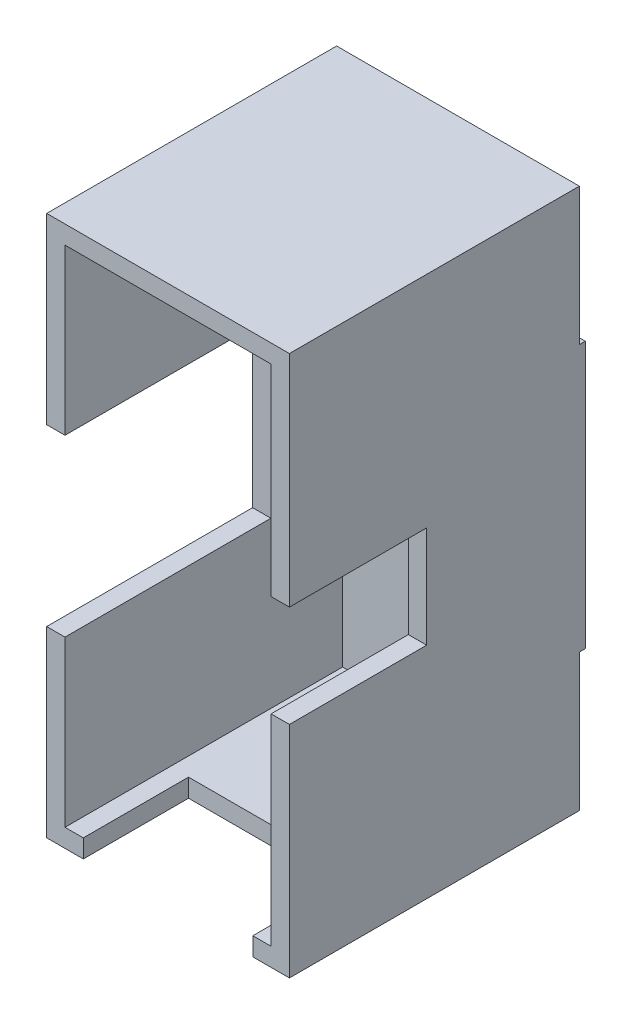
ISO-10303-21;
HEADER;
FILE_DESCRIPTION(('STEP AP214'),'2;1');
FILE_NAME('part.step','',(''),(''),'','','');
FILE_SCHEMA(('AUTOMOTIVE_DESIGN { 1 0 10303 214 1 1 1 1 }'));
ENDSEC;
DATA;
#1=APPLICATION_CONTEXT('core data for automotive mechanical design processes');
#2=APPLICATION_PROTOCOL_DEFINITION('international standard','automotive_design',2000,#1);
#3=PRODUCT_CONTEXT('',#1,'mechanical');
#4=PRODUCT('Part','Part','',(#3));
#5=PRODUCT_RELATED_PRODUCT_CATEGORY('part','',(#4));
#6=PRODUCT_DEFINITION_FORMATION('','',#4);
#7=PRODUCT_DEFINITION_CONTEXT('part definition',#1,'design');
#8=PRODUCT_DEFINITION('design','',#6,#7);
#9=PRODUCT_DEFINITION_SHAPE('','',#8);
#10=(LENGTH_UNIT() NAMED_UNIT(*) SI_UNIT(.MILLI.,.METRE.));
#11=(NAMED_UNIT(*) PLANE_ANGLE_UNIT() SI_UNIT($,.RADIAN.));
#12=(NAMED_UNIT(*) SI_UNIT($,.STERADIAN.) SOLID_ANGLE_UNIT());
#13=UNCERTAINTY_MEASURE_WITH_UNIT(LENGTH_MEASURE(1.E-05),#10,'distance_accuracy_value','');
#14=(GEOMETRIC_REPRESENTATION_CONTEXT(3) GLOBAL_UNCERTAINTY_ASSIGNED_CONTEXT((#13)) GLOBAL_UNIT_ASSIGNED_CONTEXT((#10,
#11,#12)) REPRESENTATION_CONTEXT('',''));
#15=CARTESIAN_POINT('',(0.,0.,0.));
#16=DIRECTION('',(0.,0.,1.));
#17=DIRECTION('',(1.,0.,0.));
#18=AXIS2_PLACEMENT_3D('',#15,#16,#17);
#19=CARTESIAN_POINT('',(26.525,59.1,60.67));
#20=DIRECTION('',(-1.,0.,0.));
#21=DIRECTION('',(0.,0.,1.));
#22=AXIS2_PLACEMENT_3D('',#19,#20,#21);
#23=PLANE('',#22);
#24=DIRECTION('',(0.,0.,1.));
#25=VECTOR('',#24,1.);
#26=CARTESIAN_POINT('',(26.525,29.1,-3.10648942467232E-13));
#27=LINE('',#26,#25);
#28=CARTESIAN_POINT('',(26.525,29.1,-4.));
#29=VERTEX_POINT('',#28);
#30=CARTESIAN_POINT('',(26.525,29.1,-2.7));
#31=VERTEX_POINT('',#30);
#32=EDGE_CURVE('E66',#29,#31,#27,.T.);
#33=ORIENTED_EDGE('',*,*,#32,.T.);
#34=DIRECTION('',(0.,-1.,0.));
#35=VECTOR('',#34,1.);
#36=CARTESIAN_POINT('',(26.525,0.,-2.7));
#37=LINE('',#36,#35);
#38=CARTESIAN_POINT('',(26.525,59.1,-2.7));
#39=VERTEX_POINT('',#38);
#40=EDGE_CURVE('E445',#39,#31,#37,.T.);
#41=ORIENTED_EDGE('',*,*,#40,.F.);
#42=DIRECTION('',(0.,0.,-1.));
#43=VECTOR('',#42,1.);
#44=CARTESIAN_POINT('',(26.525,59.1,60.67));
#45=LINE('',#44,#43);
#46=CARTESIAN_POINT('',(26.525,59.1,60.67));
#47=VERTEX_POINT('',#46);
#48=EDGE_CURVE('E11',#47,#39,#45,.T.);
#49=ORIENTED_EDGE('',*,*,#48,.F.);
#50=DIRECTION('',(0.,1.,0.));
#51=VECTOR('',#50,1.);
#52=CARTESIAN_POINT('',(26.525,59.1,60.67));
#53=LINE('',#52,#51);
#54=CARTESIAN_POINT('',(26.525,11.1,60.67));
#55=VERTEX_POINT('',#54);
#56=EDGE_CURVE('E255',#55,#47,#53,.T.);
#57=ORIENTED_EDGE('',*,*,#56,.F.);
#58=DIRECTION('',(0.,0.,1.));
#59=VECTOR('',#58,1.);
#60=CARTESIAN_POINT('',(26.525,11.1,60.67));
#61=LINE('',#60,#59);
#62=CARTESIAN_POINT('',(26.525,11.1,30.67));
#63=VERTEX_POINT('',#62);
#64=EDGE_CURVE('E325',#63,#55,#61,.T.);
#65=ORIENTED_EDGE('',*,*,#64,.F.);
#66=DIRECTION('',(0.,1.,0.));
#67=VECTOR('',#66,1.);
#68=CARTESIAN_POINT('',(26.525,11.1,30.67));
#69=LINE('',#68,#67);
#70=CARTESIAN_POINT('',(26.525,-11.1,30.67));
#71=VERTEX_POINT('',#70);
#72=EDGE_CURVE('E329',#71,#63,#69,.T.);
#73=ORIENTED_EDGE('',*,*,#72,.F.);
#74=DIRECTION('',(0.,0.,-1.));
#75=VECTOR('',#74,1.);
#76=CARTESIAN_POINT('',(26.525,-11.1,60.67));
#77=LINE('',#76,#75);
#78=CARTESIAN_POINT('',(26.525,-11.1,60.67));
#79=VERTEX_POINT('',#78);
#80=EDGE_CURVE('E333',#79,#71,#77,.T.);
#81=ORIENTED_EDGE('',*,*,#80,.F.);
#82=CARTESIAN_POINT('',(26.525,-59.1,60.67));
#83=VERTEX_POINT('',#82);
#84=EDGE_CURVE('E251',#83,#79,#53,.T.);
#85=ORIENTED_EDGE('',*,*,#84,.F.);
#86=DIRECTION('',(0.,0.,-1.));
#87=VECTOR('',#86,1.);
#88=CARTESIAN_POINT('',(26.525,-59.1,60.67));
#89=LINE('',#88,#87);
#90=CARTESIAN_POINT('',(26.525,-59.1,-2.7));
#91=VERTEX_POINT('',#90);
#92=EDGE_CURVE('E234',#83,#91,#89,.T.);
#93=ORIENTED_EDGE('',*,*,#92,.T.);
#94=DIRECTION('',(0.,1.,0.));
#95=VECTOR('',#94,1.);
#96=CARTESIAN_POINT('',(26.525,-59.1,-2.7));
#97=LINE('',#96,#95);
#98=CARTESIAN_POINT('',(26.525,-29.1,-2.7));
#99=VERTEX_POINT('',#98);
#100=EDGE_CURVE('E436',#91,#99,#97,.T.);
#101=ORIENTED_EDGE('',*,*,#100,.T.);
#102=DIRECTION('',(0.,0.,1.));
#103=VECTOR('',#102,1.);
#104=CARTESIAN_POINT('',(26.525,-29.1,-4.));
#105=LINE('',#104,#103);
#106=CARTESIAN_POINT('',(26.525,-29.1,-4.));
#107=VERTEX_POINT('',#106);
#108=EDGE_CURVE('E441',#107,#99,#105,.T.);
#109=ORIENTED_EDGE('',*,*,#108,.F.);
#110=DIRECTION('',(0.,1.,0.));
#111=VECTOR('',#110,1.);
#112=CARTESIAN_POINT('',(26.525,-59.1000000000002,-4.));
#113=LINE('',#112,#111);
#114=EDGE_CURVE('E307',#107,#29,#113,.T.);
#115=ORIENTED_EDGE('',*,*,#114,.T.);
#116=EDGE_LOOP('',(#33,#41,#49,#57,#65,#73,#81,#85,#93,#101,#109,#115));
#117=FACE_BOUND('',#116,.T.);
#118=ADVANCED_FACE('F43',(#117),#23,.F.);
#119=CARTESIAN_POINT('',(-26.525,59.1,60.67));
#120=DIRECTION('',(1.,0.,0.));
#121=DIRECTION('',(0.,0.,-1.));
#122=AXIS2_PLACEMENT_3D('',#119,#120,#121);
#123=PLANE('',#122);
#124=DIRECTION('',(0.,0.,1.));
#125=VECTOR('',#124,1.);
#126=CARTESIAN_POINT('',(-26.5250000000001,29.1,-3.10648942467232E-13));
#127=LINE('',#126,#125);
#128=CARTESIAN_POINT('',(-26.5250000000001,29.1,-4.));
#129=VERTEX_POINT('',#128);
#130=CARTESIAN_POINT('',(-26.5250000000001,29.1,-2.7));
#131=VERTEX_POINT('',#130);
#132=EDGE_CURVE('E216',#129,#131,#127,.T.);
#133=ORIENTED_EDGE('',*,*,#132,.F.);
#134=DIRECTION('',(0.,1.,0.));
#135=VECTOR('',#134,1.);
#136=CARTESIAN_POINT('',(-26.5250000000001,-59.1000000000002,-4.));
#137=LINE('',#136,#135);
#138=CARTESIAN_POINT('',(-26.5250000000001,-29.1,-4.));
#139=VERTEX_POINT('',#138);
#140=EDGE_CURVE('E287',#139,#129,#137,.T.);
#141=ORIENTED_EDGE('',*,*,#140,.F.);
#142=DIRECTION('',(0.,0.,1.));
#143=VECTOR('',#142,1.);
#144=CARTESIAN_POINT('',(-26.5250000000001,-29.1,-4.));
#145=LINE('',#144,#143);
#146=CARTESIAN_POINT('',(-26.5250000000001,-29.1,-2.7));
#147=VERTEX_POINT('',#146);
#148=EDGE_CURVE('E58',#139,#147,#145,.T.);
#149=ORIENTED_EDGE('',*,*,#148,.T.);
#150=DIRECTION('',(0.,1.,0.));
#151=VECTOR('',#150,1.);
#152=CARTESIAN_POINT('',(-26.5250000000001,-59.1,-2.7));
#153=LINE('',#152,#151);
#154=CARTESIAN_POINT('',(-26.5250000000001,-59.1,-2.7));
#155=VERTEX_POINT('',#154);
#156=EDGE_CURVE('E437',#155,#147,#153,.T.);
#157=ORIENTED_EDGE('',*,*,#156,.F.);
#158=DIRECTION('',(0.,0.,-1.));
#159=VECTOR('',#158,1.);
#160=CARTESIAN_POINT('',(-26.525,-59.1,60.67));
#161=LINE('',#160,#159);
#162=CARTESIAN_POINT('',(-26.525,-59.1,60.67));
#163=VERTEX_POINT('',#162);
#164=EDGE_CURVE('E231',#163,#155,#161,.T.);
#165=ORIENTED_EDGE('',*,*,#164,.F.);
#166=DIRECTION('',(0.,-1.,0.));
#167=VECTOR('',#166,1.);
#168=CARTESIAN_POINT('',(-26.525,59.1,60.67));
#169=LINE('',#168,#167);
#170=CARTESIAN_POINT('',(-26.525,-19.1,60.67));
#171=VERTEX_POINT('',#170);
#172=EDGE_CURVE('E247',#171,#163,#169,.T.);
#173=ORIENTED_EDGE('',*,*,#172,.F.);
#174=DIRECTION('',(0.,0.,1.));
#175=VECTOR('',#174,1.);
#176=CARTESIAN_POINT('',(-26.525,-19.1,60.67));
#177=LINE('',#176,#175);
#178=CARTESIAN_POINT('',(-26.525,-19.1,15.67));
#179=VERTEX_POINT('',#178);
#180=EDGE_CURVE('E361',#179,#171,#177,.T.);
#181=ORIENTED_EDGE('',*,*,#180,.F.);
#182=DIRECTION('',(0.,-1.,0.));
#183=VECTOR('',#182,1.);
#184=CARTESIAN_POINT('',(-26.525,19.1,15.67));
#185=LINE('',#184,#183);
#186=CARTESIAN_POINT('',(-26.525,19.1,15.67));
#187=VERTEX_POINT('',#186);
#188=EDGE_CURVE('E365',#187,#179,#185,.T.);
#189=ORIENTED_EDGE('',*,*,#188,.F.);
#190=DIRECTION('',(0.,0.,-1.));
#191=VECTOR('',#190,1.);
#192=CARTESIAN_POINT('',(-26.525,19.1,60.67));
#193=LINE('',#192,#191);
#194=CARTESIAN_POINT('',(-26.525,19.1,60.67));
#195=VERTEX_POINT('',#194);
#196=EDGE_CURVE('E369',#195,#187,#193,.T.);
#197=ORIENTED_EDGE('',*,*,#196,.F.);
#198=CARTESIAN_POINT('',(-26.525,59.1,60.67));
#199=VERTEX_POINT('',#198);
#200=EDGE_CURVE('E229',#199,#195,#169,.T.);
#201=ORIENTED_EDGE('',*,*,#200,.F.);
#202=DIRECTION('',(0.,0.,-1.));
#203=VECTOR('',#202,1.);
#204=CARTESIAN_POINT('',(-26.525,59.1,60.67));
#205=LINE('',#204,#203);
#206=CARTESIAN_POINT('',(-26.5250000000001,59.1,-2.7));
#207=VERTEX_POINT('',#206);
#208=EDGE_CURVE('E51',#199,#207,#205,.T.);
#209=ORIENTED_EDGE('',*,*,#208,.T.);
#210=DIRECTION('',(0.,-1.,0.));
#211=VECTOR('',#210,1.);
#212=CARTESIAN_POINT('',(-26.5250000000001,0.,-2.7));
#213=LINE('',#212,#211);
#214=EDGE_CURVE('E205',#207,#131,#213,.T.);
#215=ORIENTED_EDGE('',*,*,#214,.T.);
#216=EDGE_LOOP('',(#133,#141,#149,#157,#165,#173,#181,#189,#197,#201,#209,#215));
#217=FACE_BOUND('',#216,.T.);
#218=ADVANCED_FACE('F226',(#217),#123,.F.);
#219=CARTESIAN_POINT('',(-26.525,-59.1,60.67));
#220=DIRECTION('',(0.,1.,0.));
#221=DIRECTION('',(0.,0.,1.));
#222=AXIS2_PLACEMENT_3D('',#219,#220,#221);
#223=PLANE('',#222);
#224=DIRECTION('',(1.,0.,0.));
#225=VECTOR('',#224,1.);
#226=CARTESIAN_POINT('',(-26.5250000000001,-59.1,-2.7));
#227=LINE('',#226,#225);
#228=EDGE_CURVE('E451',#155,#91,#227,.T.);
#229=ORIENTED_EDGE('',*,*,#228,.T.);
#230=ORIENTED_EDGE('',*,*,#92,.F.);
#231=DIRECTION('',(1.,0.,0.));
#232=VECTOR('',#231,1.);
#233=CARTESIAN_POINT('',(-26.525,-59.1,60.67));
#234=LINE('',#233,#232);
#235=CARTESIAN_POINT('',(18.525,-59.1,60.67));
#236=VERTEX_POINT('',#235);
#237=EDGE_CURVE('E244',#236,#83,#234,.T.);
#238=ORIENTED_EDGE('',*,*,#237,.F.);
#239=DIRECTION('',(0.,0.,1.));
#240=VECTOR('',#239,1.);
#241=CARTESIAN_POINT('',(18.525,-59.1,60.67));
#242=LINE('',#241,#240);
#243=CARTESIAN_POINT('',(18.525,-59.1,37.67));
#244=VERTEX_POINT('',#243);
#245=EDGE_CURVE('E397',#244,#236,#242,.T.);
#246=ORIENTED_EDGE('',*,*,#245,.F.);
#247=DIRECTION('',(1.,0.,0.));
#248=VECTOR('',#247,1.);
#249=CARTESIAN_POINT('',(-18.525,-59.1,37.67));
#250=LINE('',#249,#248);
#251=CARTESIAN_POINT('',(-18.525,-59.1,37.67));
#252=VERTEX_POINT('',#251);
#253=EDGE_CURVE('E401',#252,#244,#250,.T.);
#254=ORIENTED_EDGE('',*,*,#253,.F.);
#255=DIRECTION('',(0.,0.,-1.));
#256=VECTOR('',#255,1.);
#257=CARTESIAN_POINT('',(-18.525,-59.1,60.67));
#258=LINE('',#257,#256);
#259=CARTESIAN_POINT('',(-18.525,-59.1,60.67));
#260=VERTEX_POINT('',#259);
#261=EDGE_CURVE('E405',#260,#252,#258,.T.);
#262=ORIENTED_EDGE('',*,*,#261,.F.);
#263=EDGE_CURVE('E240',#163,#260,#234,.T.);
#264=ORIENTED_EDGE('',*,*,#263,.F.);
#265=ORIENTED_EDGE('',*,*,#164,.T.);
#266=EDGE_LOOP('',(#229,#230,#238,#246,#254,#262,#264,#265));
#267=FACE_BOUND('',#266,.T.);
#268=ADVANCED_FACE('F511',(#267),#223,.F.);
#269=CARTESIAN_POINT('',(0.,0.,-4.));
#270=DIRECTION('',(0.,0.,1.));
#271=DIRECTION('',(1.,0.,0.));
#272=AXIS2_PLACEMENT_3D('',#269,#270,#271);
#273=PLANE('',#272);
#274=CARTESIAN_POINT('',(0.,0.,-4.));
#275=DIRECTION('',(0.,0.,-1.));
#276=DIRECTION('',(-1.,0.,0.));
#277=AXIS2_PLACEMENT_3D('',#274,#275,#276);
#278=CIRCLE('',#277,11.5);
#279=CARTESIAN_POINT('',(-11.5,0.,-4.));
#280=VERTEX_POINT('',#279);
#281=EDGE_CURVE('E423',#280,#280,#278,.T.);
#282=ORIENTED_EDGE('',*,*,#281,.F.);
#283=EDGE_LOOP('',(#282));
#284=FACE_BOUND('',#283,.T.);
#285=DIRECTION('',(1.,0.,0.));
#286=VECTOR('',#285,1.);
#287=CARTESIAN_POINT('',(-26.5250000000001,29.1,-4.));
#288=LINE('',#287,#286);
#289=EDGE_CURVE('E433',#129,#29,#288,.T.);
#290=ORIENTED_EDGE('',*,*,#289,.T.);
#291=ORIENTED_EDGE('',*,*,#114,.F.);
#292=DIRECTION('',(1.,0.,0.));
#293=VECTOR('',#292,1.);
#294=CARTESIAN_POINT('',(-26.5250000000001,-29.1,-4.));
#295=LINE('',#294,#293);
#296=EDGE_CURVE('E428',#139,#107,#295,.T.);
#297=ORIENTED_EDGE('',*,*,#296,.F.);
#298=ORIENTED_EDGE('',*,*,#140,.T.);
#299=EDGE_LOOP('',(#290,#291,#297,#298));
#300=FACE_BOUND('',#299,.T.);
#301=ADVANCED_FACE('F516',(#284,#300),#273,.F.);
#302=CARTESIAN_POINT('',(0.,0.,60.67));
#303=DIRECTION('',(0.,0.,1.));
#304=DIRECTION('',(1.,0.,0.));
#305=AXIS2_PLACEMENT_3D('',#302,#303,#304);
#306=PLANE('',#305);
#307=DIRECTION('',(0.,-1.,0.));
#308=VECTOR('',#307,1.);
#309=CARTESIAN_POINT('',(-18.525,-55.1,60.67));
#310=LINE('',#309,#308);
#311=CARTESIAN_POINT('',(-18.525,-55.1,60.67));
#312=VERTEX_POINT('',#311);
#313=EDGE_CURVE('E373',#312,#260,#310,.T.);
#314=ORIENTED_EDGE('',*,*,#313,.F.);
#315=DIRECTION('',(1.,0.,0.));
#316=VECTOR('',#315,1.);
#317=CARTESIAN_POINT('',(-22.525,-55.1,60.67));
#318=LINE('',#317,#316);
#319=CARTESIAN_POINT('',(-22.525,-55.1,60.67));
#320=VERTEX_POINT('',#319);
#321=EDGE_CURVE('E269',#320,#312,#318,.T.);
#322=ORIENTED_EDGE('',*,*,#321,.F.);
#323=DIRECTION('',(0.,-1.,0.));
#324=VECTOR('',#323,1.);
#325=CARTESIAN_POINT('',(-22.525,-55.1,60.67));
#326=LINE('',#325,#324);
#327=CARTESIAN_POINT('',(-22.525,-19.1,60.67));
#328=VERTEX_POINT('',#327);
#329=EDGE_CURVE('E296',#328,#320,#326,.T.);
#330=ORIENTED_EDGE('',*,*,#329,.F.);
#331=DIRECTION('',(-1.,0.,0.));
#332=VECTOR('',#331,1.);
#333=CARTESIAN_POINT('',(-22.525,-19.1,60.67));
#334=LINE('',#333,#332);
#335=EDGE_CURVE('E337',#328,#171,#334,.T.);
#336=ORIENTED_EDGE('',*,*,#335,.T.);
#337=ORIENTED_EDGE('',*,*,#172,.T.);
#338=ORIENTED_EDGE('',*,*,#263,.T.);
#339=EDGE_LOOP('',(#314,#322,#330,#336,#337,#338));
#340=FACE_BOUND('',#339,.T.);
#341=ADVANCED_FACE('F530',(#340),#306,.T.);
#342=DIRECTION('',(0.,-1.,0.));
#343=VECTOR('',#342,1.);
#344=CARTESIAN_POINT('',(18.525,-55.1,60.67));
#345=LINE('',#344,#343);
#346=CARTESIAN_POINT('',(18.525,-55.1,60.67));
#347=VERTEX_POINT('',#346);
#348=EDGE_CURVE('E391',#347,#236,#345,.T.);
#349=ORIENTED_EDGE('',*,*,#348,.T.);
#350=ORIENTED_EDGE('',*,*,#237,.T.);
#351=ORIENTED_EDGE('',*,*,#84,.T.);
#352=DIRECTION('',(1.,0.,0.));
#353=VECTOR('',#352,1.);
#354=CARTESIAN_POINT('',(22.525,-11.1,60.67));
#355=LINE('',#354,#353);
#356=CARTESIAN_POINT('',(22.525,-11.1,60.67));
#357=VERTEX_POINT('',#356);
#358=EDGE_CURVE('E312',#357,#79,#355,.T.);
#359=ORIENTED_EDGE('',*,*,#358,.F.);
#360=DIRECTION('',(0.,1.,0.));
#361=VECTOR('',#360,1.);
#362=CARTESIAN_POINT('',(22.525,-55.1,60.67));
#363=LINE('',#362,#361);
#364=CARTESIAN_POINT('',(22.525,-55.1,60.67));
#365=VERTEX_POINT('',#364);
#366=EDGE_CURVE('E300',#365,#357,#363,.T.);
#367=ORIENTED_EDGE('',*,*,#366,.F.);
#368=EDGE_CURVE('E291',#347,#365,#318,.T.);
#369=ORIENTED_EDGE('',*,*,#368,.F.);
#370=EDGE_LOOP('',(#349,#350,#351,#359,#367,#369));
#371=FACE_BOUND('',#370,.T.);
#372=ADVANCED_FACE('F567',(#371),#306,.T.);
#373=DIRECTION('',(-1.,0.,0.));
#374=VECTOR('',#373,1.);
#375=CARTESIAN_POINT('',(-22.525,19.1,60.67));
#376=LINE('',#375,#374);
#377=CARTESIAN_POINT('',(-22.525,19.1,60.67));
#378=VERTEX_POINT('',#377);
#379=EDGE_CURVE('E348',#378,#195,#376,.T.);
#380=ORIENTED_EDGE('',*,*,#379,.F.);
#381=CARTESIAN_POINT('',(-22.525,55.1,60.67));
#382=VERTEX_POINT('',#381);
#383=EDGE_CURVE('E292',#382,#378,#326,.T.);
#384=ORIENTED_EDGE('',*,*,#383,.F.);
#385=DIRECTION('',(-1.,0.,0.));
#386=VECTOR('',#385,1.);
#387=CARTESIAN_POINT('',(-22.525,55.1,60.67));
#388=LINE('',#387,#386);
#389=CARTESIAN_POINT('',(22.525,55.1,60.67));
#390=VERTEX_POINT('',#389);
#391=EDGE_CURVE('E297',#390,#382,#388,.T.);
#392=ORIENTED_EDGE('',*,*,#391,.F.);
#393=CARTESIAN_POINT('',(22.525,11.1,60.67));
#394=VERTEX_POINT('',#393);
#395=EDGE_CURVE('E274',#394,#390,#363,.T.);
#396=ORIENTED_EDGE('',*,*,#395,.F.);
#397=DIRECTION('',(1.,0.,0.));
#398=VECTOR('',#397,1.);
#399=CARTESIAN_POINT('',(22.525,11.1,60.67));
#400=LINE('',#399,#398);
#401=EDGE_CURVE('E311',#394,#55,#400,.T.);
#402=ORIENTED_EDGE('',*,*,#401,.T.);
#403=ORIENTED_EDGE('',*,*,#56,.T.);
#404=DIRECTION('',(-1.,0.,0.));
#405=VECTOR('',#404,1.);
#406=CARTESIAN_POINT('',(-26.525,59.1,60.67));
#407=LINE('',#406,#405);
#408=EDGE_CURVE('E248',#47,#199,#407,.T.);
#409=ORIENTED_EDGE('',*,*,#408,.T.);
#410=ORIENTED_EDGE('',*,*,#200,.T.);
#411=EDGE_LOOP('',(#380,#384,#392,#396,#402,#403,#409,#410));
#412=FACE_BOUND('',#411,.T.);
#413=ADVANCED_FACE('F553',(#412),#306,.T.);
#414=CARTESIAN_POINT('',(-26.525,59.1,60.67));
#415=DIRECTION('',(0.,-1.,0.));
#416=DIRECTION('',(0.,0.,-1.));
#417=AXIS2_PLACEMENT_3D('',#414,#415,#416);
#418=PLANE('',#417);
#419=ORIENTED_EDGE('',*,*,#48,.T.);
#420=DIRECTION('',(1.,0.,0.));
#421=VECTOR('',#420,1.);
#422=CARTESIAN_POINT('',(-26.5250000000001,59.1,-2.7));
#423=LINE('',#422,#421);
#424=EDGE_CURVE('E209',#207,#39,#423,.T.);
#425=ORIENTED_EDGE('',*,*,#424,.F.);
#426=ORIENTED_EDGE('',*,*,#208,.F.);
#427=ORIENTED_EDGE('',*,*,#408,.F.);
#428=EDGE_LOOP('',(#419,#425,#426,#427));
#429=FACE_BOUND('',#428,.T.);
#430=ADVANCED_FACE('F220',(#429),#418,.F.);
#431=CARTESIAN_POINT('',(22.525,-55.1,60.67));
#432=DIRECTION('',(-1.,0.,0.));
#433=DIRECTION('',(0.,0.,1.));
#434=AXIS2_PLACEMENT_3D('',#431,#432,#433);
#435=PLANE('',#434);
#436=DIRECTION('',(0.,0.,1.));
#437=VECTOR('',#436,1.);
#438=CARTESIAN_POINT('',(22.525,11.1,60.67));
#439=LINE('',#438,#437);
#440=CARTESIAN_POINT('',(22.525,11.1,30.67));
#441=VERTEX_POINT('',#440);
#442=EDGE_CURVE('E316',#441,#394,#439,.T.);
#443=ORIENTED_EDGE('',*,*,#442,.T.);
#444=ORIENTED_EDGE('',*,*,#395,.T.);
#445=DIRECTION('',(0.,0.,-1.));
#446=VECTOR('',#445,1.);
#447=CARTESIAN_POINT('',(22.525,55.1,60.67));
#448=LINE('',#447,#446);
#449=CARTESIAN_POINT('',(22.525,55.1,0.));
#450=VERTEX_POINT('',#449);
#451=EDGE_CURVE('E256',#390,#450,#448,.T.);
#452=ORIENTED_EDGE('',*,*,#451,.T.);
#453=DIRECTION('',(0.,1.,0.));
#454=VECTOR('',#453,1.);
#455=CARTESIAN_POINT('',(22.525,-55.1,0.));
#456=LINE('',#455,#454);
#457=CARTESIAN_POINT('',(22.525,-55.1,0.));
#458=VERTEX_POINT('',#457);
#459=EDGE_CURVE('E283',#458,#450,#456,.T.);
#460=ORIENTED_EDGE('',*,*,#459,.F.);
#461=DIRECTION('',(0.,0.,-1.));
#462=VECTOR('',#461,1.);
#463=CARTESIAN_POINT('',(22.525,-55.1,60.67));
#464=LINE('',#463,#462);
#465=EDGE_CURVE('E266',#365,#458,#464,.T.);
#466=ORIENTED_EDGE('',*,*,#465,.F.);
#467=ORIENTED_EDGE('',*,*,#366,.T.);
#468=DIRECTION('',(0.,0.,-1.));
#469=VECTOR('',#468,1.);
#470=CARTESIAN_POINT('',(22.525,-11.1,60.67));
#471=LINE('',#470,#469);
#472=CARTESIAN_POINT('',(22.525,-11.1,30.67));
#473=VERTEX_POINT('',#472);
#474=EDGE_CURVE('E328',#357,#473,#471,.T.);
#475=ORIENTED_EDGE('',*,*,#474,.T.);
#476=DIRECTION('',(0.,1.,0.));
#477=VECTOR('',#476,1.);
#478=CARTESIAN_POINT('',(22.525,11.1,30.67));
#479=LINE('',#478,#477);
#480=EDGE_CURVE('E341',#473,#441,#479,.T.);
#481=ORIENTED_EDGE('',*,*,#480,.T.);
#482=EDGE_LOOP('',(#443,#444,#452,#460,#466,#467,#475,#481));
#483=FACE_BOUND('',#482,.T.);
#484=ADVANCED_FACE('F543',(#483),#435,.T.);
#485=CARTESIAN_POINT('',(-22.525,55.1,60.67));
#486=DIRECTION('',(0.,-1.,0.));
#487=DIRECTION('',(0.,0.,-1.));
#488=AXIS2_PLACEMENT_3D('',#485,#486,#487);
#489=PLANE('',#488);
#490=DIRECTION('',(-1.,0.,0.));
#491=VECTOR('',#490,1.);
#492=CARTESIAN_POINT('',(-22.525,55.1,0.));
#493=LINE('',#492,#491);
#494=CARTESIAN_POINT('',(-22.525,55.1,0.));
#495=VERTEX_POINT('',#494);
#496=EDGE_CURVE('E279',#450,#495,#493,.T.);
#497=ORIENTED_EDGE('',*,*,#496,.F.);
#498=ORIENTED_EDGE('',*,*,#451,.F.);
#499=ORIENTED_EDGE('',*,*,#391,.T.);
#500=DIRECTION('',(0.,0.,-1.));
#501=VECTOR('',#500,1.);
#502=CARTESIAN_POINT('',(-22.525,55.1,60.67));
#503=LINE('',#502,#501);
#504=EDGE_CURVE('E260',#382,#495,#503,.T.);
#505=ORIENTED_EDGE('',*,*,#504,.T.);
#506=EDGE_LOOP('',(#497,#498,#499,#505));
#507=FACE_BOUND('',#506,.T.);
#508=ADVANCED_FACE('F549',(#507),#489,.T.);
#509=CARTESIAN_POINT('',(-22.525,-55.1,60.67));
#510=DIRECTION('',(1.,0.,0.));
#511=DIRECTION('',(0.,0.,-1.));
#512=AXIS2_PLACEMENT_3D('',#509,#510,#511);
#513=PLANE('',#512);
#514=DIRECTION('',(0.,0.,1.));
#515=VECTOR('',#514,1.);
#516=CARTESIAN_POINT('',(-22.525,-19.1,60.67));
#517=LINE('',#516,#515);
#518=CARTESIAN_POINT('',(-22.525,-19.1,15.67));
#519=VERTEX_POINT('',#518);
#520=EDGE_CURVE('E352',#519,#328,#517,.T.);
#521=ORIENTED_EDGE('',*,*,#520,.T.);
#522=ORIENTED_EDGE('',*,*,#329,.T.);
#523=DIRECTION('',(0.,0.,-1.));
#524=VECTOR('',#523,1.);
#525=CARTESIAN_POINT('',(-22.525,-55.1,60.67));
#526=LINE('',#525,#524);
#527=CARTESIAN_POINT('',(-22.525,-55.1,0.));
#528=VERTEX_POINT('',#527);
#529=EDGE_CURVE('E263',#320,#528,#526,.T.);
#530=ORIENTED_EDGE('',*,*,#529,.T.);
#531=DIRECTION('',(0.,-1.,0.));
#532=VECTOR('',#531,1.);
#533=CARTESIAN_POINT('',(-22.525,-55.1,0.));
#534=LINE('',#533,#532);
#535=EDGE_CURVE('E275',#495,#528,#534,.T.);
#536=ORIENTED_EDGE('',*,*,#535,.F.);
#537=ORIENTED_EDGE('',*,*,#504,.F.);
#538=ORIENTED_EDGE('',*,*,#383,.T.);
#539=DIRECTION('',(0.,0.,-1.));
#540=VECTOR('',#539,1.);
#541=CARTESIAN_POINT('',(-22.525,19.1,60.67));
#542=LINE('',#541,#540);
#543=CARTESIAN_POINT('',(-22.525,19.1,15.67));
#544=VERTEX_POINT('',#543);
#545=EDGE_CURVE('E364',#378,#544,#542,.T.);
#546=ORIENTED_EDGE('',*,*,#545,.T.);
#547=DIRECTION('',(0.,-1.,0.));
#548=VECTOR('',#547,1.);
#549=CARTESIAN_POINT('',(-22.525,19.1,15.67));
#550=LINE('',#549,#548);
#551=EDGE_CURVE('E377',#544,#519,#550,.T.);
#552=ORIENTED_EDGE('',*,*,#551,.T.);
#553=EDGE_LOOP('',(#521,#522,#530,#536,#537,#538,#546,#552));
#554=FACE_BOUND('',#553,.T.);
#555=ADVANCED_FACE('F555',(#554),#513,.T.);
#556=CARTESIAN_POINT('',(-22.525,-55.1,60.67));
#557=DIRECTION('',(0.,1.,0.));
#558=DIRECTION('',(0.,0.,1.));
#559=AXIS2_PLACEMENT_3D('',#556,#557,#558);
#560=PLANE('',#559);
#561=DIRECTION('',(0.,0.,-1.));
#562=VECTOR('',#561,1.);
#563=CARTESIAN_POINT('',(-18.525,-55.1,60.67));
#564=LINE('',#563,#562);
#565=CARTESIAN_POINT('',(-18.525,-55.1,37.67));
#566=VERTEX_POINT('',#565);
#567=EDGE_CURVE('E400',#312,#566,#564,.T.);
#568=ORIENTED_EDGE('',*,*,#567,.T.);
#569=DIRECTION('',(1.,0.,0.));
#570=VECTOR('',#569,1.);
#571=CARTESIAN_POINT('',(-18.525,-55.1,37.67));
#572=LINE('',#571,#570);
#573=CARTESIAN_POINT('',(18.525,-55.1,37.67));
#574=VERTEX_POINT('',#573);
#575=EDGE_CURVE('E413',#566,#574,#572,.T.);
#576=ORIENTED_EDGE('',*,*,#575,.T.);
#577=DIRECTION('',(0.,0.,1.));
#578=VECTOR('',#577,1.);
#579=CARTESIAN_POINT('',(18.525,-55.1,60.67));
#580=LINE('',#579,#578);
#581=EDGE_CURVE('E388',#574,#347,#580,.T.);
#582=ORIENTED_EDGE('',*,*,#581,.T.);
#583=ORIENTED_EDGE('',*,*,#368,.T.);
#584=ORIENTED_EDGE('',*,*,#465,.T.);
#585=DIRECTION('',(1.,0.,0.));
#586=VECTOR('',#585,1.);
#587=CARTESIAN_POINT('',(-22.525,-55.1,0.));
#588=LINE('',#587,#586);
#589=EDGE_CURVE('E270',#528,#458,#588,.T.);
#590=ORIENTED_EDGE('',*,*,#589,.F.);
#591=ORIENTED_EDGE('',*,*,#529,.F.);
#592=ORIENTED_EDGE('',*,*,#321,.T.);
#593=EDGE_LOOP('',(#568,#576,#582,#583,#584,#590,#591,#592));
#594=FACE_BOUND('',#593,.T.);
#595=ADVANCED_FACE('F587',(#594),#560,.T.);
#596=CARTESIAN_POINT('',(0.,0.,0.));
#597=DIRECTION('',(0.,0.,1.));
#598=DIRECTION('',(1.,0.,0.));
#599=AXIS2_PLACEMENT_3D('',#596,#597,#598);
#600=PLANE('',#599);
#601=CARTESIAN_POINT('',(0.,0.,0.));
#602=DIRECTION('',(0.,0.,1.));
#603=DIRECTION('',(1.,0.,0.));
#604=AXIS2_PLACEMENT_3D('',#601,#602,#603);
#605=CIRCLE('',#604,13.5);
#606=CARTESIAN_POINT('',(13.5,0.,0.));
#607=VERTEX_POINT('',#606);
#608=EDGE_CURVE('E409',#607,#607,#605,.T.);
#609=ORIENTED_EDGE('',*,*,#608,.F.);
#610=EDGE_LOOP('',(#609));
#611=FACE_BOUND('',#610,.T.);
#612=ORIENTED_EDGE('',*,*,#589,.T.);
#613=ORIENTED_EDGE('',*,*,#459,.T.);
#614=ORIENTED_EDGE('',*,*,#496,.T.);
#615=ORIENTED_EDGE('',*,*,#535,.T.);
#616=EDGE_LOOP('',(#612,#613,#614,#615));
#617=FACE_BOUND('',#616,.T.);
#618=ADVANCED_FACE('F560',(#611,#617),#600,.T.);
#619=CARTESIAN_POINT('',(22.525,11.1,60.67));
#620=DIRECTION('',(0.,1.,0.));
#621=DIRECTION('',(0.,0.,1.));
#622=AXIS2_PLACEMENT_3D('',#619,#620,#621);
#623=PLANE('',#622);
#624=ORIENTED_EDGE('',*,*,#64,.T.);
#625=ORIENTED_EDGE('',*,*,#401,.F.);
#626=ORIENTED_EDGE('',*,*,#442,.F.);
#627=DIRECTION('',(1.,0.,0.));
#628=VECTOR('',#627,1.);
#629=CARTESIAN_POINT('',(22.525,11.1,30.67));
#630=LINE('',#629,#628);
#631=EDGE_CURVE('E319',#441,#63,#630,.T.);
#632=ORIENTED_EDGE('',*,*,#631,.T.);
#633=EDGE_LOOP('',(#624,#625,#626,#632));
#634=FACE_BOUND('',#633,.T.);
#635=ADVANCED_FACE('F579',(#634),#623,.F.);
#636=CARTESIAN_POINT('',(22.525,11.1,30.67));
#637=DIRECTION('',(0.,0.,-1.));
#638=DIRECTION('',(0.,1.,0.));
#639=AXIS2_PLACEMENT_3D('',#636,#637,#638);
#640=PLANE('',#639);
#641=ORIENTED_EDGE('',*,*,#72,.T.);
#642=ORIENTED_EDGE('',*,*,#631,.F.);
#643=ORIENTED_EDGE('',*,*,#480,.F.);
#644=DIRECTION('',(1.,0.,0.));
#645=VECTOR('',#644,1.);
#646=CARTESIAN_POINT('',(22.525,-11.1,30.67));
#647=LINE('',#646,#645);
#648=EDGE_CURVE('E315',#473,#71,#647,.T.);
#649=ORIENTED_EDGE('',*,*,#648,.T.);
#650=EDGE_LOOP('',(#641,#642,#643,#649));
#651=FACE_BOUND('',#650,.T.);
#652=ADVANCED_FACE('F577',(#651),#640,.F.);
#653=CARTESIAN_POINT('',(22.525,-11.1,60.67));
#654=DIRECTION('',(0.,-1.,0.));
#655=DIRECTION('',(0.,0.,-1.));
#656=AXIS2_PLACEMENT_3D('',#653,#654,#655);
#657=PLANE('',#656);
#658=ORIENTED_EDGE('',*,*,#80,.T.);
#659=ORIENTED_EDGE('',*,*,#648,.F.);
#660=ORIENTED_EDGE('',*,*,#474,.F.);
#661=ORIENTED_EDGE('',*,*,#358,.T.);
#662=EDGE_LOOP('',(#658,#659,#660,#661));
#663=FACE_BOUND('',#662,.T.);
#664=ADVANCED_FACE('F571',(#663),#657,.F.);
#665=CARTESIAN_POINT('',(-22.525,-19.1,60.67));
#666=DIRECTION('',(0.,-1.,0.));
#667=DIRECTION('',(0.,0.,-1.));
#668=AXIS2_PLACEMENT_3D('',#665,#666,#667);
#669=PLANE('',#668);
#670=ORIENTED_EDGE('',*,*,#180,.T.);
#671=ORIENTED_EDGE('',*,*,#335,.F.);
#672=ORIENTED_EDGE('',*,*,#520,.F.);
#673=DIRECTION('',(-1.,0.,0.));
#674=VECTOR('',#673,1.);
#675=CARTESIAN_POINT('',(-22.525,-19.1,15.67));
#676=LINE('',#675,#674);
#677=EDGE_CURVE('E355',#519,#179,#676,.T.);
#678=ORIENTED_EDGE('',*,*,#677,.T.);
#679=EDGE_LOOP('',(#670,#671,#672,#678));
#680=FACE_BOUND('',#679,.T.);
#681=ADVANCED_FACE('F596',(#680),#669,.F.);
#682=CARTESIAN_POINT('',(-22.525,19.1,15.67));
#683=DIRECTION('',(0.,0.,-1.));
#684=DIRECTION('',(0.,1.,0.));
#685=AXIS2_PLACEMENT_3D('',#682,#683,#684);
#686=PLANE('',#685);
#687=ORIENTED_EDGE('',*,*,#188,.T.);
#688=ORIENTED_EDGE('',*,*,#677,.F.);
#689=ORIENTED_EDGE('',*,*,#551,.F.);
#690=DIRECTION('',(-1.,0.,0.));
#691=VECTOR('',#690,1.);
#692=CARTESIAN_POINT('',(-22.525,19.1,15.67));
#693=LINE('',#692,#691);
#694=EDGE_CURVE('E351',#544,#187,#693,.T.);
#695=ORIENTED_EDGE('',*,*,#694,.T.);
#696=EDGE_LOOP('',(#687,#688,#689,#695));
#697=FACE_BOUND('',#696,.T.);
#698=ADVANCED_FACE('F705',(#697),#686,.F.);
#699=CARTESIAN_POINT('',(-22.525,19.1,60.67));
#700=DIRECTION('',(0.,1.,0.));
#701=DIRECTION('',(0.,0.,1.));
#702=AXIS2_PLACEMENT_3D('',#699,#700,#701);
#703=PLANE('',#702);
#704=ORIENTED_EDGE('',*,*,#196,.T.);
#705=ORIENTED_EDGE('',*,*,#694,.F.);
#706=ORIENTED_EDGE('',*,*,#545,.F.);
#707=ORIENTED_EDGE('',*,*,#379,.T.);
#708=EDGE_LOOP('',(#704,#705,#706,#707));
#709=FACE_BOUND('',#708,.T.);
#710=ADVANCED_FACE('F591',(#709),#703,.F.);
#711=CARTESIAN_POINT('',(-18.525,-55.1,60.67));
#712=DIRECTION('',(-1.,0.,0.));
#713=DIRECTION('',(0.,0.,1.));
#714=AXIS2_PLACEMENT_3D('',#711,#712,#713);
#715=PLANE('',#714);
#716=ORIENTED_EDGE('',*,*,#261,.T.);
#717=DIRECTION('',(0.,-1.,0.));
#718=VECTOR('',#717,1.);
#719=CARTESIAN_POINT('',(-18.525,-55.1,37.67));
#720=LINE('',#719,#718);
#721=EDGE_CURVE('E384',#566,#252,#720,.T.);
#722=ORIENTED_EDGE('',*,*,#721,.F.);
#723=ORIENTED_EDGE('',*,*,#567,.F.);
#724=ORIENTED_EDGE('',*,*,#313,.T.);
#725=EDGE_LOOP('',(#716,#722,#723,#724));
#726=FACE_BOUND('',#725,.T.);
#727=ADVANCED_FACE('F722',(#726),#715,.F.);
#728=CARTESIAN_POINT('',(18.525,-55.1,60.67));
#729=DIRECTION('',(1.,0.,0.));
#730=DIRECTION('',(0.,0.,-1.));
#731=AXIS2_PLACEMENT_3D('',#728,#729,#730);
#732=PLANE('',#731);
#733=ORIENTED_EDGE('',*,*,#245,.T.);
#734=ORIENTED_EDGE('',*,*,#348,.F.);
#735=ORIENTED_EDGE('',*,*,#581,.F.);
#736=DIRECTION('',(0.,-1.,0.));
#737=VECTOR('',#736,1.);
#738=CARTESIAN_POINT('',(18.525,-55.1,37.67));
#739=LINE('',#738,#737);
#740=EDGE_CURVE('E387',#574,#244,#739,.T.);
#741=ORIENTED_EDGE('',*,*,#740,.T.);
#742=EDGE_LOOP('',(#733,#734,#735,#741));
#743=FACE_BOUND('',#742,.T.);
#744=ADVANCED_FACE('F502',(#743),#732,.F.);
#745=CARTESIAN_POINT('',(-18.525,-55.1,37.67));
#746=DIRECTION('',(0.,0.,-1.));
#747=DIRECTION('',(-1.,0.,0.));
#748=AXIS2_PLACEMENT_3D('',#745,#746,#747);
#749=PLANE('',#748);
#750=ORIENTED_EDGE('',*,*,#253,.T.);
#751=ORIENTED_EDGE('',*,*,#740,.F.);
#752=ORIENTED_EDGE('',*,*,#575,.F.);
#753=ORIENTED_EDGE('',*,*,#721,.T.);
#754=EDGE_LOOP('',(#750,#751,#752,#753));
#755=FACE_BOUND('',#754,.T.);
#756=ADVANCED_FACE('F492',(#755),#749,.F.);
#757=CARTESIAN_POINT('',(0.,0.,3.4));
#758=DIRECTION('',(0.,0.,-1.));
#759=DIRECTION('',(-1.,0.,0.));
#760=AXIS2_PLACEMENT_3D('',#757,#758,#759);
#761=CYLINDRICAL_SURFACE('',#760,13.5);
#762=ORIENTED_EDGE('',*,*,#608,.T.);
#763=EDGE_LOOP('',(#762));
#764=FACE_BOUND('',#763,.T.);
#765=CARTESIAN_POINT('',(0.,0.,6.4));
#766=DIRECTION('',(0.,0.,1.));
#767=DIRECTION('',(1.,0.,0.));
#768=AXIS2_PLACEMENT_3D('',#765,#766,#767);
#769=CIRCLE('',#768,13.5);
#770=CARTESIAN_POINT('',(13.5,0.,6.4));
#771=VERTEX_POINT('',#770);
#772=EDGE_CURVE('E429',#771,#771,#769,.T.);
#773=ORIENTED_EDGE('',*,*,#772,.F.);
#774=EDGE_LOOP('',(#773));
#775=FACE_BOUND('',#774,.T.);
#776=ADVANCED_FACE('F489',(#764,#775),#761,.T.);
#777=CARTESIAN_POINT('',(0.,0.,3.4));
#778=DIRECTION('',(0.,0.,-1.));
#779=DIRECTION('',(-1.,0.,0.));
#780=AXIS2_PLACEMENT_3D('',#777,#778,#779);
#781=CYLINDRICAL_SURFACE('',#780,11.5);
#782=ORIENTED_EDGE('',*,*,#281,.T.);
#783=EDGE_LOOP('',(#782));
#784=FACE_BOUND('',#783,.T.);
#785=CARTESIAN_POINT('',(0.,0.,3.4));
#786=DIRECTION('',(0.,0.,1.));
#787=DIRECTION('',(1.,0.,0.));
#788=AXIS2_PLACEMENT_3D('',#785,#786,#787);
#789=CIRCLE('',#788,11.5);
#790=CARTESIAN_POINT('',(11.5,0.,3.4));
#791=VERTEX_POINT('',#790);
#792=EDGE_CURVE('E424',#791,#791,#789,.T.);
#793=ORIENTED_EDGE('',*,*,#792,.T.);
#794=EDGE_LOOP('',(#793));
#795=FACE_BOUND('',#794,.T.);
#796=ADVANCED_FACE('F491',(#784,#795),#781,.F.);
#797=CARTESIAN_POINT('',(-26.5250000000001,-29.1,-4.));
#798=DIRECTION('',(0.,1.,0.));
#799=DIRECTION('',(0.,0.,1.));
#800=AXIS2_PLACEMENT_3D('',#797,#798,#799);
#801=PLANE('',#800);
#802=ORIENTED_EDGE('',*,*,#108,.T.);
#803=DIRECTION('',(1.,0.,0.));
#804=VECTOR('',#803,1.);
#805=CARTESIAN_POINT('',(-26.5250000000001,-29.1,-2.7));
#806=LINE('',#805,#804);
#807=EDGE_CURVE('E440',#147,#99,#806,.T.);
#808=ORIENTED_EDGE('',*,*,#807,.F.);
#809=ORIENTED_EDGE('',*,*,#148,.F.);
#810=ORIENTED_EDGE('',*,*,#296,.T.);
#811=EDGE_LOOP('',(#802,#808,#809,#810));
#812=FACE_BOUND('',#811,.T.);
#813=ADVANCED_FACE('F499',(#812),#801,.F.);
#814=CARTESIAN_POINT('',(-26.5250000000001,-59.1,-2.7));
#815=DIRECTION('',(0.,0.,-1.));
#816=DIRECTION('',(-1.,0.,0.));
#817=AXIS2_PLACEMENT_3D('',#814,#815,#816);
#818=PLANE('',#817);
#819=ORIENTED_EDGE('',*,*,#100,.F.);
#820=ORIENTED_EDGE('',*,*,#228,.F.);
#821=ORIENTED_EDGE('',*,*,#156,.T.);
#822=ORIENTED_EDGE('',*,*,#807,.T.);
#823=EDGE_LOOP('',(#819,#820,#821,#822));
#824=FACE_BOUND('',#823,.T.);
#825=ADVANCED_FACE('F803',(#824),#818,.T.);
#826=CARTESIAN_POINT('',(-26.5250000000001,29.1,-3.10648942467232E-13));
#827=DIRECTION('',(0.,1.,0.));
#828=DIRECTION('',(0.,0.,1.));
#829=AXIS2_PLACEMENT_3D('',#826,#827,#828);
#830=PLANE('',#829);
#831=ORIENTED_EDGE('',*,*,#32,.F.);
#832=ORIENTED_EDGE('',*,*,#289,.F.);
#833=ORIENTED_EDGE('',*,*,#132,.T.);
#834=DIRECTION('',(1.,0.,0.));
#835=VECTOR('',#834,1.);
#836=CARTESIAN_POINT('',(-26.5250000000001,29.1,-2.7));
#837=LINE('',#836,#835);
#838=EDGE_CURVE('E211',#131,#31,#837,.T.);
#839=ORIENTED_EDGE('',*,*,#838,.T.);
#840=EDGE_LOOP('',(#831,#832,#833,#839));
#841=FACE_BOUND('',#840,.T.);
#842=ADVANCED_FACE('F518',(#841),#830,.T.);
#843=CARTESIAN_POINT('',(-26.5250000000001,0.,-2.7));
#844=DIRECTION('',(0.,0.,1.));
#845=DIRECTION('',(1.,0.,0.));
#846=AXIS2_PLACEMENT_3D('',#843,#844,#845);
#847=PLANE('',#846);
#848=ORIENTED_EDGE('',*,*,#40,.T.);
#849=ORIENTED_EDGE('',*,*,#838,.F.);
#850=ORIENTED_EDGE('',*,*,#214,.F.);
#851=ORIENTED_EDGE('',*,*,#424,.T.);
#852=EDGE_LOOP('',(#848,#849,#850,#851));
#853=FACE_BOUND('',#852,.T.);
#854=ADVANCED_FACE('F208',(#853),#847,.F.);
#855=CARTESIAN_POINT('',(0.,0.,3.4));
#856=DIRECTION('',(0.,0.,1.));
#857=DIRECTION('',(1.,0.,0.));
#858=AXIS2_PLACEMENT_3D('',#855,#856,#857);
#859=PLANE('',#858);
#860=CARTESIAN_POINT('',(0.,0.,3.4));
#861=DIRECTION('',(0.,0.,1.));
#862=DIRECTION('',(1.,0.,0.));
#863=AXIS2_PLACEMENT_3D('',#860,#861,#862);
#864=CIRCLE('',#863,3.325);
#865=CARTESIAN_POINT('',(3.325,0.,3.4));
#866=VERTEX_POINT('',#865);
#867=EDGE_CURVE('E470',#866,#866,#864,.T.);
#868=ORIENTED_EDGE('',*,*,#867,.T.);
#869=EDGE_LOOP('',(#868));
#870=FACE_BOUND('',#869,.T.);
#871=ORIENTED_EDGE('',*,*,#792,.F.);
#872=EDGE_LOOP('',(#871));
#873=FACE_BOUND('',#872,.T.);
#874=ADVANCED_FACE('F485',(#870,#873),#859,.F.);
#875=CARTESIAN_POINT('',(0.,0.,6.4));
#876=DIRECTION('',(0.,0.,1.));
#877=DIRECTION('',(1.,0.,0.));
#878=AXIS2_PLACEMENT_3D('',#875,#876,#877);
#879=PLANE('',#878);
#880=CARTESIAN_POINT('',(0.,0.,6.4));
#881=DIRECTION('',(0.,0.,1.));
#882=DIRECTION('',(1.,0.,0.));
#883=AXIS2_PLACEMENT_3D('',#880,#881,#882);
#884=CIRCLE('',#883,3.325);
#885=CARTESIAN_POINT('',(3.325,0.,6.4));
#886=VERTEX_POINT('',#885);
#887=EDGE_CURVE('E474',#886,#886,#884,.T.);
#888=ORIENTED_EDGE('',*,*,#887,.F.);
#889=EDGE_LOOP('',(#888));
#890=FACE_BOUND('',#889,.T.);
#891=ORIENTED_EDGE('',*,*,#772,.T.);
#892=EDGE_LOOP('',(#891));
#893=FACE_BOUND('',#892,.T.);
#894=ADVANCED_FACE('F482',(#890,#893),#879,.T.);
#895=CARTESIAN_POINT('',(0.,0.,-4.));
#896=DIRECTION('',(0.,0.,1.));
#897=DIRECTION('',(1.,0.,0.));
#898=AXIS2_PLACEMENT_3D('',#895,#896,#897);
#899=CYLINDRICAL_SURFACE('',#898,3.325);
#900=ORIENTED_EDGE('',*,*,#887,.T.);
#901=EDGE_LOOP('',(#900));
#902=FACE_BOUND('',#901,.T.);
#903=ORIENTED_EDGE('',*,*,#867,.F.);
#904=EDGE_LOOP('',(#903));
#905=FACE_BOUND('',#904,.T.);
#906=ADVANCED_FACE('F479',(#902,#905),#899,.F.);
#907=CLOSED_SHELL('',(#118,#218,#268,#301,#341,#372,#413,#430,#484,#508,#555,#595,#618,#635,
#652,#664,#681,#698,#710,#727,#744,#756,#776,#796,#813,#825,#842,#854,#874,#894,#906));
#908=MANIFOLD_SOLID_BREP('B2',#907);
#909=ADVANCED_BREP_SHAPE_REPRESENTATION('',(#18,#908),#14);
#910=SHAPE_DEFINITION_REPRESENTATION(#9,#909);
ENDSEC;
END-ISO-10303-21;
